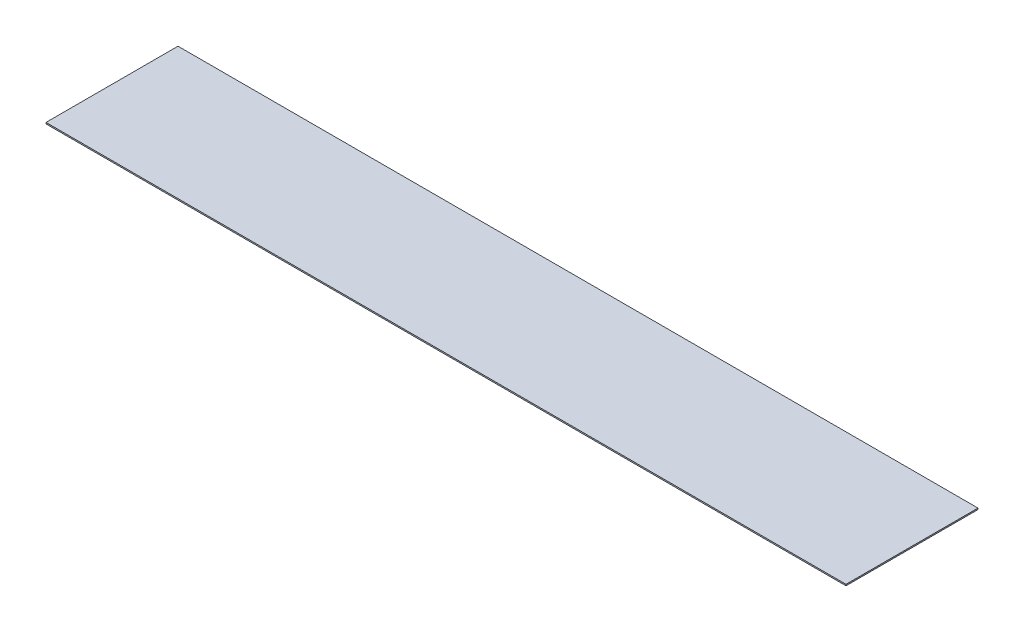
ISO-10303-21;
HEADER;
FILE_DESCRIPTION(('STEP AP214'),'2;1');
FILE_NAME('part.step','',(''),(''),'','','');
FILE_SCHEMA(('AUTOMOTIVE_DESIGN { 1 0 10303 214 1 1 1 1 }'));
ENDSEC;
DATA;
#1=APPLICATION_CONTEXT('core data for automotive mechanical design processes');
#2=APPLICATION_PROTOCOL_DEFINITION('international standard','automotive_design',2000,#1);
#3=PRODUCT_CONTEXT('',#1,'mechanical');
#4=PRODUCT('Part','Part','',(#3));
#5=PRODUCT_RELATED_PRODUCT_CATEGORY('part','',(#4));
#6=PRODUCT_DEFINITION_FORMATION('','',#4);
#7=PRODUCT_DEFINITION_CONTEXT('part definition',#1,'design');
#8=PRODUCT_DEFINITION('design','',#6,#7);
#9=PRODUCT_DEFINITION_SHAPE('','',#8);
#10=(LENGTH_UNIT() NAMED_UNIT(*) SI_UNIT(.MILLI.,.METRE.));
#11=(NAMED_UNIT(*) PLANE_ANGLE_UNIT() SI_UNIT($,.RADIAN.));
#12=(NAMED_UNIT(*) SI_UNIT($,.STERADIAN.) SOLID_ANGLE_UNIT());
#13=UNCERTAINTY_MEASURE_WITH_UNIT(LENGTH_MEASURE(1.E-05),#10,'distance_accuracy_value','');
#14=(GEOMETRIC_REPRESENTATION_CONTEXT(3) GLOBAL_UNCERTAINTY_ASSIGNED_CONTEXT((#13)) GLOBAL_UNIT_ASSIGNED_CONTEXT((#10,
#11,#12)) REPRESENTATION_CONTEXT('',''));
#15=CARTESIAN_POINT('',(0.,0.,0.));
#16=DIRECTION('',(0.,0.,1.));
#17=DIRECTION('',(1.,0.,0.));
#18=AXIS2_PLACEMENT_3D('',#15,#16,#17);
#19=CARTESIAN_POINT('',(-600.,-2.,99.0000000000001));
#20=DIRECTION('',(-1.,0.,0.));
#21=DIRECTION('',(0.,0.,1.));
#22=AXIS2_PLACEMENT_3D('',#19,#20,#21);
#23=PLANE('',#22);
#24=DIRECTION('',(0.,0.,1.));
#25=VECTOR('',#24,1.);
#26=CARTESIAN_POINT('',(-600.,0.,99.0000000000001));
#27=LINE('',#26,#25);
#28=CARTESIAN_POINT('',(-600.,0.,-98.9999999999999));
#29=VERTEX_POINT('',#28);
#30=CARTESIAN_POINT('',(-600.,0.,99.0000000000001));
#31=VERTEX_POINT('',#30);
#32=EDGE_CURVE('E105',#29,#31,#27,.T.);
#33=ORIENTED_EDGE('',*,*,#32,.F.);
#34=DIRECTION('',(0.,1.,0.));
#35=VECTOR('',#34,1.);
#36=CARTESIAN_POINT('',(-600.,-2.,-98.9999999999999));
#37=LINE('',#36,#35);
#38=CARTESIAN_POINT('',(-600.,-2.,-98.9999999999999));
#39=VERTEX_POINT('',#38);
#40=EDGE_CURVE('E11',#39,#29,#37,.T.);
#41=ORIENTED_EDGE('',*,*,#40,.F.);
#42=DIRECTION('',(0.,0.,1.));
#43=VECTOR('',#42,1.);
#44=CARTESIAN_POINT('',(-600.,-2.,99.0000000000001));
#45=LINE('',#44,#43);
#46=CARTESIAN_POINT('',(-600.,-2.,99.0000000000001));
#47=VERTEX_POINT('',#46);
#48=EDGE_CURVE('E99',#39,#47,#45,.T.);
#49=ORIENTED_EDGE('',*,*,#48,.T.);
#50=DIRECTION('',(0.,1.,0.));
#51=VECTOR('',#50,1.);
#52=CARTESIAN_POINT('',(-600.,-2.,99.0000000000001));
#53=LINE('',#52,#51);
#54=EDGE_CURVE('E44',#47,#31,#53,.T.);
#55=ORIENTED_EDGE('',*,*,#54,.T.);
#56=EDGE_LOOP('',(#33,#41,#49,#55));
#57=FACE_BOUND('',#56,.T.);
#58=ADVANCED_FACE('F41',(#57),#23,.T.);
#59=CARTESIAN_POINT('',(600.,-2.,-99.0000000000001));
#60=DIRECTION('',(0.,0.,-1.));
#61=DIRECTION('',(-1.,0.,0.));
#62=AXIS2_PLACEMENT_3D('',#59,#60,#61);
#63=PLANE('',#62);
#64=DIRECTION('',(-1.,0.,0.));
#65=VECTOR('',#64,1.);
#66=CARTESIAN_POINT('',(600.,0.,-99.0000000000001));
#67=LINE('',#66,#65);
#68=CARTESIAN_POINT('',(600.,0.,-99.0000000000001));
#69=VERTEX_POINT('',#68);
#70=EDGE_CURVE('E101',#69,#29,#67,.T.);
#71=ORIENTED_EDGE('',*,*,#70,.F.);
#72=DIRECTION('',(0.,1.,0.));
#73=VECTOR('',#72,1.);
#74=CARTESIAN_POINT('',(600.,-2.,-99.0000000000001));
#75=LINE('',#74,#73);
#76=CARTESIAN_POINT('',(600.,-2.,-99.0000000000001));
#77=VERTEX_POINT('',#76);
#78=EDGE_CURVE('E50',#77,#69,#75,.T.);
#79=ORIENTED_EDGE('',*,*,#78,.F.);
#80=DIRECTION('',(-1.,0.,0.));
#81=VECTOR('',#80,1.);
#82=CARTESIAN_POINT('',(600.,-2.,-99.0000000000001));
#83=LINE('',#82,#81);
#84=EDGE_CURVE('E96',#77,#39,#83,.T.);
#85=ORIENTED_EDGE('',*,*,#84,.T.);
#86=ORIENTED_EDGE('',*,*,#40,.T.);
#87=EDGE_LOOP('',(#71,#79,#85,#86));
#88=FACE_BOUND('',#87,.T.);
#89=ADVANCED_FACE('F115',(#88),#63,.T.);
#90=CARTESIAN_POINT('',(600.,-2.,98.9999999999999));
#91=DIRECTION('',(1.,0.,0.));
#92=DIRECTION('',(0.,0.,-1.));
#93=AXIS2_PLACEMENT_3D('',#90,#91,#92);
#94=PLANE('',#93);
#95=DIRECTION('',(0.,0.,-1.));
#96=VECTOR('',#95,1.);
#97=CARTESIAN_POINT('',(600.,0.,98.9999999999999));
#98=LINE('',#97,#96);
#99=CARTESIAN_POINT('',(600.,0.,98.9999999999999));
#100=VERTEX_POINT('',#99);
#101=EDGE_CURVE('E91',#100,#69,#98,.T.);
#102=ORIENTED_EDGE('',*,*,#101,.F.);
#103=DIRECTION('',(0.,1.,0.));
#104=VECTOR('',#103,1.);
#105=CARTESIAN_POINT('',(600.,-2.,98.9999999999999));
#106=LINE('',#105,#104);
#107=CARTESIAN_POINT('',(600.,-2.,98.9999999999999));
#108=VERTEX_POINT('',#107);
#109=EDGE_CURVE('E86',#108,#100,#106,.T.);
#110=ORIENTED_EDGE('',*,*,#109,.F.);
#111=DIRECTION('',(0.,0.,-1.));
#112=VECTOR('',#111,1.);
#113=CARTESIAN_POINT('',(600.,-2.,98.9999999999999));
#114=LINE('',#113,#112);
#115=EDGE_CURVE('E89',#108,#77,#114,.T.);
#116=ORIENTED_EDGE('',*,*,#115,.T.);
#117=ORIENTED_EDGE('',*,*,#78,.T.);
#118=EDGE_LOOP('',(#102,#110,#116,#117));
#119=FACE_BOUND('',#118,.T.);
#120=ADVANCED_FACE('F88',(#119),#94,.T.);
#121=CARTESIAN_POINT('',(600.,-2.,98.9999999999999));
#122=DIRECTION('',(0.,0.,1.));
#123=DIRECTION('',(1.,0.,0.));
#124=AXIS2_PLACEMENT_3D('',#121,#122,#123);
#125=PLANE('',#124);
#126=DIRECTION('',(1.,0.,0.));
#127=VECTOR('',#126,1.);
#128=CARTESIAN_POINT('',(600.,0.,98.9999999999999));
#129=LINE('',#128,#127);
#130=EDGE_CURVE('E108',#31,#100,#129,.T.);
#131=ORIENTED_EDGE('',*,*,#130,.F.);
#132=ORIENTED_EDGE('',*,*,#54,.F.);
#133=DIRECTION('',(1.,0.,0.));
#134=VECTOR('',#133,1.);
#135=CARTESIAN_POINT('',(600.,-2.,98.9999999999999));
#136=LINE('',#135,#134);
#137=EDGE_CURVE('E95',#47,#108,#136,.T.);
#138=ORIENTED_EDGE('',*,*,#137,.T.);
#139=ORIENTED_EDGE('',*,*,#109,.T.);
#140=EDGE_LOOP('',(#131,#132,#138,#139));
#141=FACE_BOUND('',#140,.T.);
#142=ADVANCED_FACE('F98',(#141),#125,.T.);
#143=CARTESIAN_POINT('',(0.,-2.,0.));
#144=DIRECTION('',(0.,1.,0.));
#145=DIRECTION('',(0.,0.,1.));
#146=AXIS2_PLACEMENT_3D('',#143,#144,#145);
#147=PLANE('',#146);
#148=ORIENTED_EDGE('',*,*,#48,.F.);
#149=ORIENTED_EDGE('',*,*,#84,.F.);
#150=ORIENTED_EDGE('',*,*,#115,.F.);
#151=ORIENTED_EDGE('',*,*,#137,.F.);
#152=EDGE_LOOP('',(#148,#149,#150,#151));
#153=FACE_BOUND('',#152,.T.);
#154=ADVANCED_FACE('F94',(#153),#147,.F.);
#155=CARTESIAN_POINT('',(0.,0.,0.));
#156=DIRECTION('',(0.,1.,0.));
#157=DIRECTION('',(0.,0.,1.));
#158=AXIS2_PLACEMENT_3D('',#155,#156,#157);
#159=PLANE('',#158);
#160=ORIENTED_EDGE('',*,*,#32,.T.);
#161=ORIENTED_EDGE('',*,*,#130,.T.);
#162=ORIENTED_EDGE('',*,*,#101,.T.);
#163=ORIENTED_EDGE('',*,*,#70,.T.);
#164=EDGE_LOOP('',(#160,#161,#162,#163));
#165=FACE_BOUND('',#164,.T.);
#166=ADVANCED_FACE('F114',(#165),#159,.T.);
#167=CLOSED_SHELL('',(#58,#89,#120,#142,#154,#166));
#168=MANIFOLD_SOLID_BREP('B2',#167);
#169=ADVANCED_BREP_SHAPE_REPRESENTATION('',(#18,#168),#14);
#170=SHAPE_DEFINITION_REPRESENTATION(#9,#169);
ENDSEC;
END-ISO-10303-21;
